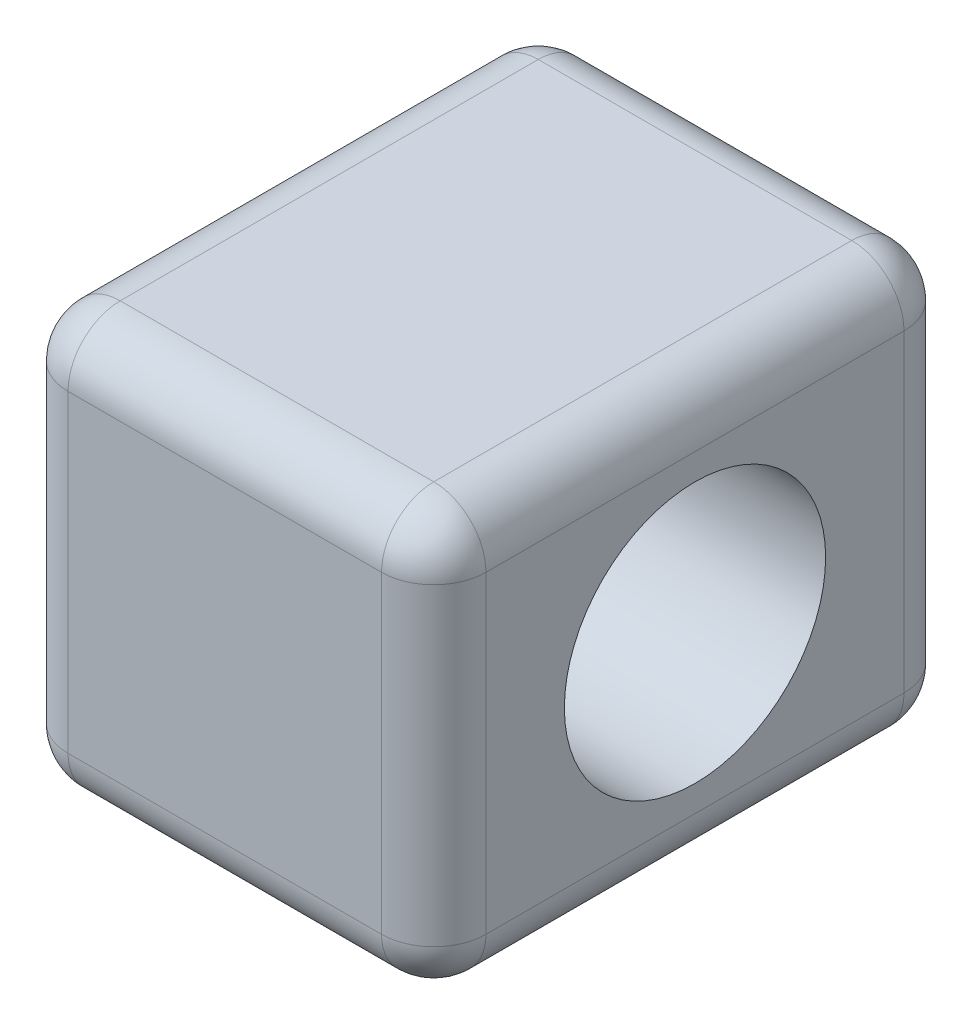
ISO-10303-21;
HEADER;
FILE_DESCRIPTION(('STEP AP214'),'2;1');
FILE_NAME('part.step','',(''),(''),'','','');
FILE_SCHEMA(('AUTOMOTIVE_DESIGN { 1 0 10303 214 1 1 1 1 }'));
ENDSEC;
DATA;
#1=APPLICATION_CONTEXT('core data for automotive mechanical design processes');
#2=APPLICATION_PROTOCOL_DEFINITION('international standard','automotive_design',2000,#1);
#3=PRODUCT_CONTEXT('',#1,'mechanical');
#4=PRODUCT('Part','Part','',(#3));
#5=PRODUCT_RELATED_PRODUCT_CATEGORY('part','',(#4));
#6=PRODUCT_DEFINITION_FORMATION('','',#4);
#7=PRODUCT_DEFINITION_CONTEXT('part definition',#1,'design');
#8=PRODUCT_DEFINITION('design','',#6,#7);
#9=PRODUCT_DEFINITION_SHAPE('','',#8);
#10=(LENGTH_UNIT() NAMED_UNIT(*) SI_UNIT(.MILLI.,.METRE.));
#11=(NAMED_UNIT(*) PLANE_ANGLE_UNIT() SI_UNIT($,.RADIAN.));
#12=(NAMED_UNIT(*) SI_UNIT($,.STERADIAN.) SOLID_ANGLE_UNIT());
#13=UNCERTAINTY_MEASURE_WITH_UNIT(LENGTH_MEASURE(1.E-05),#10,'distance_accuracy_value','');
#14=(GEOMETRIC_REPRESENTATION_CONTEXT(3) GLOBAL_UNCERTAINTY_ASSIGNED_CONTEXT((#13)) GLOBAL_UNIT_ASSIGNED_CONTEXT((#10,
#11,#12)) REPRESENTATION_CONTEXT('',''));
#15=CARTESIAN_POINT('',(0.,0.,0.));
#16=DIRECTION('',(0.,0.,1.));
#17=DIRECTION('',(1.,0.,0.));
#18=AXIS2_PLACEMENT_3D('',#15,#16,#17);
#19=CARTESIAN_POINT('',(0.,8.,10.));
#20=DIRECTION('',(1.,0.,0.));
#21=DIRECTION('',(0.,0.,-1.));
#22=AXIS2_PLACEMENT_3D('',#19,#20,#21);
#23=PLANE('',#22);
#24=DIRECTION('',(0.,-1.,0.));
#25=VECTOR('',#24,1.);
#26=CARTESIAN_POINT('',(0.,8.,0.999999999999999));
#27=LINE('',#26,#25);
#28=CARTESIAN_POINT('',(0.,7.,0.999999999999999));
#29=VERTEX_POINT('',#28);
#30=CARTESIAN_POINT('',(0.,1.,0.999999999999999));
#31=VERTEX_POINT('',#30);
#32=EDGE_CURVE('E165',#29,#31,#27,.T.);
#33=ORIENTED_EDGE('',*,*,#32,.T.);
#34=DIRECTION('',(0.,0.,-1.));
#35=VECTOR('',#34,1.);
#36=CARTESIAN_POINT('',(0.,1.,10.));
#37=LINE('',#36,#35);
#38=CARTESIAN_POINT('',(0.,1.,9.));
#39=VERTEX_POINT('',#38);
#40=EDGE_CURVE('E135',#31,#39,#37,.F.);
#41=ORIENTED_EDGE('',*,*,#40,.T.);
#42=DIRECTION('',(0.,-1.,0.));
#43=VECTOR('',#42,1.);
#44=CARTESIAN_POINT('',(0.,8.,9.));
#45=LINE('',#44,#43);
#46=CARTESIAN_POINT('',(0.,7.,9.));
#47=VERTEX_POINT('',#46);
#48=EDGE_CURVE('E172',#39,#47,#45,.F.);
#49=ORIENTED_EDGE('',*,*,#48,.T.);
#50=DIRECTION('',(0.,0.,-1.));
#51=VECTOR('',#50,1.);
#52=CARTESIAN_POINT('',(0.,7.,10.));
#53=LINE('',#52,#51);
#54=EDGE_CURVE('E170',#47,#29,#53,.T.);
#55=ORIENTED_EDGE('',*,*,#54,.T.);
#56=EDGE_LOOP('',(#33,#41,#49,#55));
#57=FACE_BOUND('',#56,.T.);
#58=CARTESIAN_POINT('',(0.,4.,5.));
#59=DIRECTION('',(1.,0.,0.));
#60=DIRECTION('',(0.,0.,-1.));
#61=AXIS2_PLACEMENT_3D('',#58,#59,#60);
#62=CIRCLE('',#61,2.5);
#63=CARTESIAN_POINT('',(0.,4.,2.5));
#64=VERTEX_POINT('',#63);
#65=EDGE_CURVE('E158',#64,#64,#62,.T.);
#66=ORIENTED_EDGE('',*,*,#65,.T.);
#67=EDGE_LOOP('',(#66));
#68=FACE_BOUND('',#67,.T.);
#69=ADVANCED_FACE('F39',(#57,#68),#23,.F.);
#70=CARTESIAN_POINT('',(0.,0.,10.));
#71=DIRECTION('',(0.,1.,0.));
#72=DIRECTION('',(0.,0.,1.));
#73=AXIS2_PLACEMENT_3D('',#70,#71,#72);
#74=PLANE('',#73);
#75=DIRECTION('',(0.,0.,-1.));
#76=VECTOR('',#75,1.);
#77=CARTESIAN_POINT('',(7.,0.,10.));
#78=LINE('',#77,#76);
#79=CARTESIAN_POINT('',(7.,0.,0.999999999999999));
#80=VERTEX_POINT('',#79);
#81=CARTESIAN_POINT('',(7.,0.,9.));
#82=VERTEX_POINT('',#81);
#83=EDGE_CURVE('E157',#80,#82,#78,.F.);
#84=ORIENTED_EDGE('',*,*,#83,.T.);
#85=DIRECTION('',(1.,0.,0.));
#86=VECTOR('',#85,1.);
#87=CARTESIAN_POINT('',(0.,0.,9.));
#88=LINE('',#87,#86);
#89=CARTESIAN_POINT('',(1.,0.,9.));
#90=VERTEX_POINT('',#89);
#91=EDGE_CURVE('E162',#82,#90,#88,.F.);
#92=ORIENTED_EDGE('',*,*,#91,.T.);
#93=DIRECTION('',(0.,0.,-1.));
#94=VECTOR('',#93,1.);
#95=CARTESIAN_POINT('',(1.,0.,10.));
#96=LINE('',#95,#94);
#97=CARTESIAN_POINT('',(1.,0.,0.999999999999999));
#98=VERTEX_POINT('',#97);
#99=EDGE_CURVE('E133',#90,#98,#96,.T.);
#100=ORIENTED_EDGE('',*,*,#99,.T.);
#101=DIRECTION('',(1.,0.,0.));
#102=VECTOR('',#101,1.);
#103=CARTESIAN_POINT('',(0.,0.,0.999999999999999));
#104=LINE('',#103,#102);
#105=EDGE_CURVE('E151',#98,#80,#104,.T.);
#106=ORIENTED_EDGE('',*,*,#105,.T.);
#107=EDGE_LOOP('',(#84,#92,#100,#106));
#108=FACE_BOUND('',#107,.T.);
#109=ADVANCED_FACE('F160',(#108),#74,.F.);
#110=CARTESIAN_POINT('',(8.,8.,10.));
#111=DIRECTION('',(-1.,0.,0.));
#112=DIRECTION('',(0.,0.,1.));
#113=AXIS2_PLACEMENT_3D('',#110,#111,#112);
#114=PLANE('',#113);
#115=DIRECTION('',(0.,1.,0.));
#116=VECTOR('',#115,1.);
#117=CARTESIAN_POINT('',(8.,0.,9.));
#118=LINE('',#117,#116);
#119=CARTESIAN_POINT('',(8.,7.,9.));
#120=VERTEX_POINT('',#119);
#121=CARTESIAN_POINT('',(8.,1.,9.));
#122=VERTEX_POINT('',#121);
#123=EDGE_CURVE('E179',#120,#122,#118,.F.);
#124=ORIENTED_EDGE('',*,*,#123,.T.);
#125=DIRECTION('',(0.,0.,-1.));
#126=VECTOR('',#125,1.);
#127=CARTESIAN_POINT('',(8.,1.,10.));
#128=LINE('',#127,#126);
#129=CARTESIAN_POINT('',(8.,1.,0.999999999999999));
#130=VERTEX_POINT('',#129);
#131=EDGE_CURVE('E181',#122,#130,#128,.T.);
#132=ORIENTED_EDGE('',*,*,#131,.T.);
#133=DIRECTION('',(0.,1.,0.));
#134=VECTOR('',#133,1.);
#135=CARTESIAN_POINT('',(8.,8.,0.999999999999999));
#136=LINE('',#135,#134);
#137=CARTESIAN_POINT('',(8.,7.,0.999999999999999));
#138=VERTEX_POINT('',#137);
#139=EDGE_CURVE('E175',#130,#138,#136,.T.);
#140=ORIENTED_EDGE('',*,*,#139,.T.);
#141=DIRECTION('',(0.,0.,-1.));
#142=VECTOR('',#141,1.);
#143=CARTESIAN_POINT('',(8.,7.,10.));
#144=LINE('',#143,#142);
#145=EDGE_CURVE('E177',#138,#120,#144,.F.);
#146=ORIENTED_EDGE('',*,*,#145,.T.);
#147=EDGE_LOOP('',(#124,#132,#140,#146));
#148=FACE_BOUND('',#147,.T.);
#149=CARTESIAN_POINT('',(8.,4.,5.));
#150=DIRECTION('',(1.,0.,0.));
#151=DIRECTION('',(0.,0.,-1.));
#152=AXIS2_PLACEMENT_3D('',#149,#150,#151);
#153=CIRCLE('',#152,2.5);
#154=CARTESIAN_POINT('',(8.,4.,2.5));
#155=VERTEX_POINT('',#154);
#156=EDGE_CURVE('E263',#155,#155,#153,.T.);
#157=ORIENTED_EDGE('',*,*,#156,.F.);
#158=EDGE_LOOP('',(#157));
#159=FACE_BOUND('',#158,.T.);
#160=ADVANCED_FACE('F296',(#148,#159),#114,.F.);
#161=CARTESIAN_POINT('',(0.,8.,10.));
#162=DIRECTION('',(0.,-1.,0.));
#163=DIRECTION('',(0.,0.,-1.));
#164=AXIS2_PLACEMENT_3D('',#161,#162,#163);
#165=PLANE('',#164);
#166=DIRECTION('',(-1.,0.,0.));
#167=VECTOR('',#166,1.);
#168=CARTESIAN_POINT('',(8.,8.,9.));
#169=LINE('',#168,#167);
#170=CARTESIAN_POINT('',(1.,8.,9.));
#171=VERTEX_POINT('',#170);
#172=CARTESIAN_POINT('',(7.,8.,9.));
#173=VERTEX_POINT('',#172);
#174=EDGE_CURVE('E197',#171,#173,#169,.F.);
#175=ORIENTED_EDGE('',*,*,#174,.T.);
#176=DIRECTION('',(0.,0.,-1.));
#177=VECTOR('',#176,1.);
#178=CARTESIAN_POINT('',(7.,8.,10.));
#179=LINE('',#178,#177);
#180=CARTESIAN_POINT('',(7.,8.,0.999999999999999));
#181=VERTEX_POINT('',#180);
#182=EDGE_CURVE('E199',#173,#181,#179,.T.);
#183=ORIENTED_EDGE('',*,*,#182,.T.);
#184=DIRECTION('',(-1.,0.,0.));
#185=VECTOR('',#184,1.);
#186=CARTESIAN_POINT('',(0.,8.,0.999999999999999));
#187=LINE('',#186,#185);
#188=CARTESIAN_POINT('',(1.,8.,0.999999999999999));
#189=VERTEX_POINT('',#188);
#190=EDGE_CURVE('E193',#181,#189,#187,.T.);
#191=ORIENTED_EDGE('',*,*,#190,.T.);
#192=DIRECTION('',(0.,0.,-1.));
#193=VECTOR('',#192,1.);
#194=CARTESIAN_POINT('',(1.,8.,10.));
#195=LINE('',#194,#193);
#196=EDGE_CURVE('E195',#189,#171,#195,.F.);
#197=ORIENTED_EDGE('',*,*,#196,.T.);
#198=EDGE_LOOP('',(#175,#183,#191,#197));
#199=FACE_BOUND('',#198,.T.);
#200=ADVANCED_FACE('F380',(#199),#165,.F.);
#201=CARTESIAN_POINT('',(0.,0.,10.));
#202=DIRECTION('',(0.,0.,1.));
#203=DIRECTION('',(1.,0.,0.));
#204=AXIS2_PLACEMENT_3D('',#201,#202,#203);
#205=PLANE('',#204);
#206=DIRECTION('',(1.,0.,0.));
#207=VECTOR('',#206,1.);
#208=CARTESIAN_POINT('',(8.,1.,10.));
#209=LINE('',#208,#207);
#210=CARTESIAN_POINT('',(1.,1.,10.));
#211=VERTEX_POINT('',#210);
#212=CARTESIAN_POINT('',(7.,1.,10.));
#213=VERTEX_POINT('',#212);
#214=EDGE_CURVE('E188',#211,#213,#209,.T.);
#215=ORIENTED_EDGE('',*,*,#214,.T.);
#216=DIRECTION('',(0.,1.,0.));
#217=VECTOR('',#216,1.);
#218=CARTESIAN_POINT('',(7.,8.,10.));
#219=LINE('',#218,#217);
#220=CARTESIAN_POINT('',(7.,7.,10.));
#221=VERTEX_POINT('',#220);
#222=EDGE_CURVE('E190',#213,#221,#219,.T.);
#223=ORIENTED_EDGE('',*,*,#222,.T.);
#224=DIRECTION('',(-1.,0.,0.));
#225=VECTOR('',#224,1.);
#226=CARTESIAN_POINT('',(0.,7.,10.));
#227=LINE('',#226,#225);
#228=CARTESIAN_POINT('',(1.,7.,10.));
#229=VERTEX_POINT('',#228);
#230=EDGE_CURVE('E184',#221,#229,#227,.T.);
#231=ORIENTED_EDGE('',*,*,#230,.T.);
#232=DIRECTION('',(0.,-1.,0.));
#233=VECTOR('',#232,1.);
#234=CARTESIAN_POINT('',(1.,0.,10.));
#235=LINE('',#234,#233);
#236=EDGE_CURVE('E186',#229,#211,#235,.T.);
#237=ORIENTED_EDGE('',*,*,#236,.T.);
#238=EDGE_LOOP('',(#215,#223,#231,#237));
#239=FACE_BOUND('',#238,.T.);
#240=ADVANCED_FACE('F287',(#239),#205,.T.);
#241=CARTESIAN_POINT('',(0.,0.,0.));
#242=DIRECTION('',(0.,0.,1.));
#243=DIRECTION('',(1.,0.,0.));
#244=AXIS2_PLACEMENT_3D('',#241,#242,#243);
#245=PLANE('',#244);
#246=DIRECTION('',(0.,1.,0.));
#247=VECTOR('',#246,1.);
#248=CARTESIAN_POINT('',(7.,0.,0.));
#249=LINE('',#248,#247);
#250=CARTESIAN_POINT('',(7.,7.,0.));
#251=VERTEX_POINT('',#250);
#252=CARTESIAN_POINT('',(7.,1.,0.));
#253=VERTEX_POINT('',#252);
#254=EDGE_CURVE('E48',#251,#253,#249,.F.);
#255=ORIENTED_EDGE('',*,*,#254,.T.);
#256=DIRECTION('',(1.,0.,0.));
#257=VECTOR('',#256,1.);
#258=CARTESIAN_POINT('',(0.,1.,0.));
#259=LINE('',#258,#257);
#260=CARTESIAN_POINT('',(1.,1.,0.));
#261=VERTEX_POINT('',#260);
#262=EDGE_CURVE('E11',#253,#261,#259,.F.);
#263=ORIENTED_EDGE('',*,*,#262,.T.);
#264=DIRECTION('',(0.,-1.,0.));
#265=VECTOR('',#264,1.);
#266=CARTESIAN_POINT('',(1.,0.,0.));
#267=LINE('',#266,#265);
#268=CARTESIAN_POINT('',(1.,7.,0.));
#269=VERTEX_POINT('',#268);
#270=EDGE_CURVE('E202',#261,#269,#267,.F.);
#271=ORIENTED_EDGE('',*,*,#270,.T.);
#272=DIRECTION('',(-1.,0.,0.));
#273=VECTOR('',#272,1.);
#274=CARTESIAN_POINT('',(0.,7.,0.));
#275=LINE('',#274,#273);
#276=EDGE_CURVE('E59',#269,#251,#275,.F.);
#277=ORIENTED_EDGE('',*,*,#276,.T.);
#278=EDGE_LOOP('',(#255,#263,#271,#277));
#279=FACE_BOUND('',#278,.T.);
#280=ADVANCED_FACE('F279',(#279),#245,.F.);
#281=CARTESIAN_POINT('',(0.,4.,5.));
#282=DIRECTION('',(1.,0.,0.));
#283=DIRECTION('',(0.,0.,-1.));
#284=AXIS2_PLACEMENT_3D('',#281,#282,#283);
#285=CYLINDRICAL_SURFACE('',#284,2.5);
#286=ORIENTED_EDGE('',*,*,#65,.F.);
#287=EDGE_LOOP('',(#286));
#288=FACE_BOUND('',#287,.T.);
#289=ORIENTED_EDGE('',*,*,#156,.T.);
#290=EDGE_LOOP('',(#289));
#291=FACE_BOUND('',#290,.T.);
#292=ADVANCED_FACE('F277',(#288,#291),#285,.F.);
#293=CARTESIAN_POINT('',(7.,7.,10.));
#294=DIRECTION('',(0.,0.,-1.));
#295=DIRECTION('',(-1.,0.,0.));
#296=AXIS2_PLACEMENT_3D('',#293,#294,#295);
#297=CYLINDRICAL_SURFACE('',#296,1.);
#298=CARTESIAN_POINT('',(7.,7.,9.));
#299=DIRECTION('',(0.,0.,1.));
#300=DIRECTION('',(1.,0.,0.));
#301=AXIS2_PLACEMENT_3D('',#298,#299,#300);
#302=CIRCLE('',#301,1.);
#303=EDGE_CURVE('E43',#120,#173,#302,.T.);
#304=ORIENTED_EDGE('',*,*,#303,.F.);
#305=ORIENTED_EDGE('',*,*,#145,.F.);
#306=CARTESIAN_POINT('',(7.,7.,0.999999999999999));
#307=DIRECTION('',(0.,0.,-1.));
#308=DIRECTION('',(-1.,0.,0.));
#309=AXIS2_PLACEMENT_3D('',#306,#307,#308);
#310=CIRCLE('',#309,1.);
#311=EDGE_CURVE('E256',#181,#138,#310,.T.);
#312=ORIENTED_EDGE('',*,*,#311,.F.);
#313=ORIENTED_EDGE('',*,*,#182,.F.);
#314=EDGE_LOOP('',(#304,#305,#312,#313));
#315=FACE_BOUND('',#314,.T.);
#316=ADVANCED_FACE('F41',(#315),#297,.T.);
#317=CARTESIAN_POINT('',(7.,7.,9.));
#318=DIRECTION('',(0.,1.,0.));
#319=DIRECTION('',(0.,0.,1.));
#320=AXIS2_PLACEMENT_3D('',#317,#318,#319);
#321=SPHERICAL_SURFACE('',#320,1.);
#322=CARTESIAN_POINT('',(7.,7.,9.));
#323=DIRECTION('',(0.,1.,0.));
#324=DIRECTION('',(0.,0.,1.));
#325=AXIS2_PLACEMENT_3D('',#322,#323,#324);
#326=CIRCLE('',#325,1.);
#327=EDGE_CURVE('E251',#120,#221,#326,.F.);
#328=ORIENTED_EDGE('',*,*,#327,.F.);
#329=ORIENTED_EDGE('',*,*,#303,.T.);
#330=CARTESIAN_POINT('',(7.,7.,9.));
#331=DIRECTION('',(1.,0.,0.));
#332=DIRECTION('',(0.,0.,-1.));
#333=AXIS2_PLACEMENT_3D('',#330,#331,#332);
#334=CIRCLE('',#333,1.);
#335=EDGE_CURVE('E254',#221,#173,#334,.F.);
#336=ORIENTED_EDGE('',*,*,#335,.F.);
#337=EDGE_LOOP('',(#328,#329,#336));
#338=FACE_BOUND('',#337,.T.);
#339=ADVANCED_FACE('F285',(#338),#321,.T.);
#340=CARTESIAN_POINT('',(7.,7.,1.));
#341=DIRECTION('',(1.,0.,0.));
#342=DIRECTION('',(0.,0.,-1.));
#343=AXIS2_PLACEMENT_3D('',#340,#341,#342);
#344=SPHERICAL_SURFACE('',#343,1.);
#345=CARTESIAN_POINT('',(7.,7.,1.));
#346=DIRECTION('',(1.,0.,0.));
#347=DIRECTION('',(0.,0.,-1.));
#348=AXIS2_PLACEMENT_3D('',#345,#346,#347);
#349=CIRCLE('',#348,1.);
#350=EDGE_CURVE('E246',#181,#251,#349,.F.);
#351=ORIENTED_EDGE('',*,*,#350,.F.);
#352=ORIENTED_EDGE('',*,*,#311,.T.);
#353=CARTESIAN_POINT('',(7.,7.,0.999999999999999));
#354=DIRECTION('',(0.,1.,0.));
#355=DIRECTION('',(0.,0.,1.));
#356=AXIS2_PLACEMENT_3D('',#353,#354,#355);
#357=CIRCLE('',#356,1.);
#358=EDGE_CURVE('E248',#251,#138,#357,.F.);
#359=ORIENTED_EDGE('',*,*,#358,.F.);
#360=EDGE_LOOP('',(#351,#352,#359));
#361=FACE_BOUND('',#360,.T.);
#362=ADVANCED_FACE('F361',(#361),#344,.T.);
#363=CARTESIAN_POINT('',(0.,7.,9.));
#364=DIRECTION('',(1.,0.,0.));
#365=DIRECTION('',(0.,0.,-1.));
#366=AXIS2_PLACEMENT_3D('',#363,#364,#365);
#367=CYLINDRICAL_SURFACE('',#366,1.);
#368=ORIENTED_EDGE('',*,*,#335,.T.);
#369=ORIENTED_EDGE('',*,*,#174,.F.);
#370=CARTESIAN_POINT('',(1.,7.,9.));
#371=DIRECTION('',(-1.,0.,0.));
#372=DIRECTION('',(0.,0.,1.));
#373=AXIS2_PLACEMENT_3D('',#370,#371,#372);
#374=CIRCLE('',#373,1.);
#375=EDGE_CURVE('E240',#229,#171,#374,.T.);
#376=ORIENTED_EDGE('',*,*,#375,.F.);
#377=ORIENTED_EDGE('',*,*,#230,.F.);
#378=EDGE_LOOP('',(#368,#369,#376,#377));
#379=FACE_BOUND('',#378,.T.);
#380=ADVANCED_FACE('F357',(#379),#367,.T.);
#381=CARTESIAN_POINT('',(7.,0.,9.));
#382=DIRECTION('',(0.,-1.,0.));
#383=DIRECTION('',(0.,0.,-1.));
#384=AXIS2_PLACEMENT_3D('',#381,#382,#383);
#385=CYLINDRICAL_SURFACE('',#384,1.);
#386=ORIENTED_EDGE('',*,*,#327,.T.);
#387=ORIENTED_EDGE('',*,*,#222,.F.);
#388=CARTESIAN_POINT('',(7.,1.,9.));
#389=DIRECTION('',(0.,-1.,0.));
#390=DIRECTION('',(0.,0.,-1.));
#391=AXIS2_PLACEMENT_3D('',#388,#389,#390);
#392=CIRCLE('',#391,1.);
#393=EDGE_CURVE('E237',#122,#213,#392,.T.);
#394=ORIENTED_EDGE('',*,*,#393,.F.);
#395=ORIENTED_EDGE('',*,*,#123,.F.);
#396=EDGE_LOOP('',(#386,#387,#394,#395));
#397=FACE_BOUND('',#396,.T.);
#398=ADVANCED_FACE('F353',(#397),#385,.T.);
#399=CARTESIAN_POINT('',(7.,1.,10.));
#400=DIRECTION('',(0.,0.,-1.));
#401=DIRECTION('',(-1.,0.,0.));
#402=AXIS2_PLACEMENT_3D('',#399,#400,#401);
#403=CYLINDRICAL_SURFACE('',#402,1.);
#404=CARTESIAN_POINT('',(7.,1.,0.999999999999999));
#405=DIRECTION('',(0.,0.,-1.));
#406=DIRECTION('',(-1.,0.,0.));
#407=AXIS2_PLACEMENT_3D('',#404,#405,#406);
#408=CIRCLE('',#407,1.);
#409=EDGE_CURVE('E231',#130,#80,#408,.T.);
#410=ORIENTED_EDGE('',*,*,#409,.F.);
#411=ORIENTED_EDGE('',*,*,#131,.F.);
#412=CARTESIAN_POINT('',(7.,1.,9.));
#413=DIRECTION('',(0.,0.,1.));
#414=DIRECTION('',(1.,0.,0.));
#415=AXIS2_PLACEMENT_3D('',#412,#413,#414);
#416=CIRCLE('',#415,1.);
#417=EDGE_CURVE('E234',#82,#122,#416,.T.);
#418=ORIENTED_EDGE('',*,*,#417,.F.);
#419=ORIENTED_EDGE('',*,*,#83,.F.);
#420=EDGE_LOOP('',(#410,#411,#418,#419));
#421=FACE_BOUND('',#420,.T.);
#422=ADVANCED_FACE('F349',(#421),#403,.T.);
#423=CARTESIAN_POINT('',(7.,8.,0.999999999999999));
#424=DIRECTION('',(0.,1.,0.));
#425=DIRECTION('',(0.,0.,1.));
#426=AXIS2_PLACEMENT_3D('',#423,#424,#425);
#427=CYLINDRICAL_SURFACE('',#426,1.);
#428=ORIENTED_EDGE('',*,*,#358,.T.);
#429=ORIENTED_EDGE('',*,*,#139,.F.);
#430=CARTESIAN_POINT('',(7.,1.,1.));
#431=DIRECTION('',(0.,-1.,0.));
#432=DIRECTION('',(0.,0.,-1.));
#433=AXIS2_PLACEMENT_3D('',#430,#431,#432);
#434=CIRCLE('',#433,1.);
#435=EDGE_CURVE('E229',#253,#130,#434,.T.);
#436=ORIENTED_EDGE('',*,*,#435,.F.);
#437=ORIENTED_EDGE('',*,*,#254,.F.);
#438=EDGE_LOOP('',(#428,#429,#436,#437));
#439=FACE_BOUND('',#438,.T.);
#440=ADVANCED_FACE('F345',(#439),#427,.T.);
#441=CARTESIAN_POINT('',(0.,7.,0.999999999999999));
#442=DIRECTION('',(-1.,0.,0.));
#443=DIRECTION('',(0.,0.,1.));
#444=AXIS2_PLACEMENT_3D('',#441,#442,#443);
#445=CYLINDRICAL_SURFACE('',#444,1.);
#446=ORIENTED_EDGE('',*,*,#350,.T.);
#447=ORIENTED_EDGE('',*,*,#276,.F.);
#448=CARTESIAN_POINT('',(1.,7.,0.999999999999999));
#449=DIRECTION('',(-1.,0.,0.));
#450=DIRECTION('',(0.,0.,1.));
#451=AXIS2_PLACEMENT_3D('',#448,#449,#450);
#452=CIRCLE('',#451,1.);
#453=EDGE_CURVE('E226',#189,#269,#452,.T.);
#454=ORIENTED_EDGE('',*,*,#453,.F.);
#455=ORIENTED_EDGE('',*,*,#190,.F.);
#456=EDGE_LOOP('',(#446,#447,#454,#455));
#457=FACE_BOUND('',#456,.T.);
#458=ADVANCED_FACE('F341',(#457),#445,.T.);
#459=CARTESIAN_POINT('',(1.,7.,10.));
#460=DIRECTION('',(0.,0.,-1.));
#461=DIRECTION('',(-1.,0.,0.));
#462=AXIS2_PLACEMENT_3D('',#459,#460,#461);
#463=CYLINDRICAL_SURFACE('',#462,1.);
#464=CARTESIAN_POINT('',(1.,7.,9.));
#465=DIRECTION('',(0.,0.,1.));
#466=DIRECTION('',(1.,0.,0.));
#467=AXIS2_PLACEMENT_3D('',#464,#465,#466);
#468=CIRCLE('',#467,1.);
#469=EDGE_CURVE('E243',#171,#47,#468,.T.);
#470=ORIENTED_EDGE('',*,*,#469,.F.);
#471=ORIENTED_EDGE('',*,*,#196,.F.);
#472=CARTESIAN_POINT('',(1.,7.,0.999999999999999));
#473=DIRECTION('',(0.,0.,-1.));
#474=DIRECTION('',(-1.,0.,0.));
#475=AXIS2_PLACEMENT_3D('',#472,#473,#474);
#476=CIRCLE('',#475,1.);
#477=EDGE_CURVE('E223',#29,#189,#476,.T.);
#478=ORIENTED_EDGE('',*,*,#477,.F.);
#479=ORIENTED_EDGE('',*,*,#54,.F.);
#480=EDGE_LOOP('',(#470,#471,#478,#479));
#481=FACE_BOUND('',#480,.T.);
#482=ADVANCED_FACE('F337',(#481),#463,.T.);
#483=CARTESIAN_POINT('',(1.,7.,9.));
#484=DIRECTION('',(0.,1.,0.));
#485=DIRECTION('',(0.,0.,1.));
#486=AXIS2_PLACEMENT_3D('',#483,#484,#485);
#487=SPHERICAL_SURFACE('',#486,1.);
#488=ORIENTED_EDGE('',*,*,#375,.T.);
#489=ORIENTED_EDGE('',*,*,#469,.T.);
#490=CARTESIAN_POINT('',(1.,7.,9.));
#491=DIRECTION('',(0.,1.,0.));
#492=DIRECTION('',(0.,0.,1.));
#493=AXIS2_PLACEMENT_3D('',#490,#491,#492);
#494=CIRCLE('',#493,1.);
#495=EDGE_CURVE('E220',#229,#47,#494,.F.);
#496=ORIENTED_EDGE('',*,*,#495,.F.);
#497=EDGE_LOOP('',(#488,#489,#496));
#498=FACE_BOUND('',#497,.T.);
#499=ADVANCED_FACE('F333',(#498),#487,.T.);
#500=CARTESIAN_POINT('',(7.,1.,9.));
#501=DIRECTION('',(1.,0.,0.));
#502=DIRECTION('',(0.,0.,-1.));
#503=AXIS2_PLACEMENT_3D('',#500,#501,#502);
#504=SPHERICAL_SURFACE('',#503,1.);
#505=ORIENTED_EDGE('',*,*,#417,.T.);
#506=ORIENTED_EDGE('',*,*,#393,.T.);
#507=CARTESIAN_POINT('',(7.,1.,9.));
#508=DIRECTION('',(1.,0.,0.));
#509=DIRECTION('',(0.,0.,-1.));
#510=AXIS2_PLACEMENT_3D('',#507,#508,#509);
#511=CIRCLE('',#510,1.);
#512=EDGE_CURVE('E217',#82,#213,#511,.F.);
#513=ORIENTED_EDGE('',*,*,#512,.F.);
#514=EDGE_LOOP('',(#505,#506,#513));
#515=FACE_BOUND('',#514,.T.);
#516=ADVANCED_FACE('F329',(#515),#504,.T.);
#517=CARTESIAN_POINT('',(7.,1.,1.));
#518=DIRECTION('',(1.,0.,0.));
#519=DIRECTION('',(0.,0.,-1.));
#520=AXIS2_PLACEMENT_3D('',#517,#518,#519);
#521=SPHERICAL_SURFACE('',#520,1.);
#522=ORIENTED_EDGE('',*,*,#435,.T.);
#523=ORIENTED_EDGE('',*,*,#409,.T.);
#524=CARTESIAN_POINT('',(7.,1.,0.999999999999999));
#525=DIRECTION('',(1.,0.,0.));
#526=DIRECTION('',(0.,0.,-1.));
#527=AXIS2_PLACEMENT_3D('',#524,#525,#526);
#528=CIRCLE('',#527,1.);
#529=EDGE_CURVE('E154',#253,#80,#528,.F.);
#530=ORIENTED_EDGE('',*,*,#529,.F.);
#531=EDGE_LOOP('',(#522,#523,#530));
#532=FACE_BOUND('',#531,.T.);
#533=ADVANCED_FACE('F325',(#532),#521,.T.);
#534=CARTESIAN_POINT('',(1.,7.,1.));
#535=DIRECTION('',(0.,1.,0.));
#536=DIRECTION('',(0.,0.,1.));
#537=AXIS2_PLACEMENT_3D('',#534,#535,#536);
#538=SPHERICAL_SURFACE('',#537,1.);
#539=ORIENTED_EDGE('',*,*,#477,.T.);
#540=ORIENTED_EDGE('',*,*,#453,.T.);
#541=CARTESIAN_POINT('',(1.,7.,1.));
#542=DIRECTION('',(0.,1.,0.));
#543=DIRECTION('',(0.,0.,1.));
#544=AXIS2_PLACEMENT_3D('',#541,#542,#543);
#545=CIRCLE('',#544,1.);
#546=EDGE_CURVE('E213',#29,#269,#545,.F.);
#547=ORIENTED_EDGE('',*,*,#546,.F.);
#548=EDGE_LOOP('',(#539,#540,#547));
#549=FACE_BOUND('',#548,.T.);
#550=ADVANCED_FACE('F321',(#549),#538,.T.);
#551=CARTESIAN_POINT('',(1.,0.,9.));
#552=DIRECTION('',(0.,1.,0.));
#553=DIRECTION('',(0.,0.,1.));
#554=AXIS2_PLACEMENT_3D('',#551,#552,#553);
#555=CYLINDRICAL_SURFACE('',#554,1.);
#556=ORIENTED_EDGE('',*,*,#495,.T.);
#557=ORIENTED_EDGE('',*,*,#48,.F.);
#558=CARTESIAN_POINT('',(1.,1.,9.));
#559=DIRECTION('',(0.,-1.,0.));
#560=DIRECTION('',(0.,0.,-1.));
#561=AXIS2_PLACEMENT_3D('',#558,#559,#560);
#562=CIRCLE('',#561,1.);
#563=EDGE_CURVE('E210',#211,#39,#562,.T.);
#564=ORIENTED_EDGE('',*,*,#563,.F.);
#565=ORIENTED_EDGE('',*,*,#236,.F.);
#566=EDGE_LOOP('',(#556,#557,#564,#565));
#567=FACE_BOUND('',#566,.T.);
#568=ADVANCED_FACE('F317',(#567),#555,.T.);
#569=CARTESIAN_POINT('',(0.,1.,9.));
#570=DIRECTION('',(-1.,0.,0.));
#571=DIRECTION('',(0.,0.,1.));
#572=AXIS2_PLACEMENT_3D('',#569,#570,#571);
#573=CYLINDRICAL_SURFACE('',#572,1.);
#574=ORIENTED_EDGE('',*,*,#512,.T.);
#575=ORIENTED_EDGE('',*,*,#214,.F.);
#576=CARTESIAN_POINT('',(1.,1.,9.));
#577=DIRECTION('',(-1.,0.,0.));
#578=DIRECTION('',(0.,0.,1.));
#579=AXIS2_PLACEMENT_3D('',#576,#577,#578);
#580=CIRCLE('',#579,1.);
#581=EDGE_CURVE('E148',#90,#211,#580,.T.);
#582=ORIENTED_EDGE('',*,*,#581,.F.);
#583=ORIENTED_EDGE('',*,*,#91,.F.);
#584=EDGE_LOOP('',(#574,#575,#582,#583));
#585=FACE_BOUND('',#584,.T.);
#586=ADVANCED_FACE('F314',(#585),#573,.T.);
#587=CARTESIAN_POINT('',(0.,1.,0.999999999999999));
#588=DIRECTION('',(1.,0.,0.));
#589=DIRECTION('',(0.,0.,-1.));
#590=AXIS2_PLACEMENT_3D('',#587,#588,#589);
#591=CYLINDRICAL_SURFACE('',#590,1.);
#592=ORIENTED_EDGE('',*,*,#529,.T.);
#593=ORIENTED_EDGE('',*,*,#105,.F.);
#594=CARTESIAN_POINT('',(1.,1.,1.));
#595=DIRECTION('',(-1.,0.,0.));
#596=DIRECTION('',(0.,0.,1.));
#597=AXIS2_PLACEMENT_3D('',#594,#595,#596);
#598=CIRCLE('',#597,1.);
#599=EDGE_CURVE('E140',#261,#98,#598,.T.);
#600=ORIENTED_EDGE('',*,*,#599,.F.);
#601=ORIENTED_EDGE('',*,*,#262,.F.);
#602=EDGE_LOOP('',(#592,#593,#600,#601));
#603=FACE_BOUND('',#602,.T.);
#604=ADVANCED_FACE('F152',(#603),#591,.T.);
#605=CARTESIAN_POINT('',(1.,8.,0.999999999999999));
#606=DIRECTION('',(0.,-1.,0.));
#607=DIRECTION('',(0.,0.,-1.));
#608=AXIS2_PLACEMENT_3D('',#605,#606,#607);
#609=CYLINDRICAL_SURFACE('',#608,1.);
#610=ORIENTED_EDGE('',*,*,#546,.T.);
#611=ORIENTED_EDGE('',*,*,#270,.F.);
#612=CARTESIAN_POINT('',(1.,1.,0.999999999999999));
#613=DIRECTION('',(0.,-1.,0.));
#614=DIRECTION('',(0.,0.,-1.));
#615=AXIS2_PLACEMENT_3D('',#612,#613,#614);
#616=CIRCLE('',#615,1.);
#617=EDGE_CURVE('E144',#31,#261,#616,.T.);
#618=ORIENTED_EDGE('',*,*,#617,.F.);
#619=ORIENTED_EDGE('',*,*,#32,.F.);
#620=EDGE_LOOP('',(#610,#611,#618,#619));
#621=FACE_BOUND('',#620,.T.);
#622=ADVANCED_FACE('F307',(#621),#609,.T.);
#623=CARTESIAN_POINT('',(1.,1.,9.));
#624=DIRECTION('',(0.,0.,1.));
#625=DIRECTION('',(1.,0.,0.));
#626=AXIS2_PLACEMENT_3D('',#623,#624,#625);
#627=SPHERICAL_SURFACE('',#626,1.);
#628=ORIENTED_EDGE('',*,*,#581,.T.);
#629=ORIENTED_EDGE('',*,*,#563,.T.);
#630=CARTESIAN_POINT('',(1.,1.,9.));
#631=DIRECTION('',(0.,0.,1.));
#632=DIRECTION('',(1.,0.,0.));
#633=AXIS2_PLACEMENT_3D('',#630,#631,#632);
#634=CIRCLE('',#633,1.);
#635=EDGE_CURVE('E137',#90,#39,#634,.F.);
#636=ORIENTED_EDGE('',*,*,#635,.F.);
#637=EDGE_LOOP('',(#628,#629,#636));
#638=FACE_BOUND('',#637,.T.);
#639=ADVANCED_FACE('F304',(#638),#627,.T.);
#640=CARTESIAN_POINT('',(1.,1.,1.));
#641=DIRECTION('',(0.,0.,-1.));
#642=DIRECTION('',(-1.,0.,0.));
#643=AXIS2_PLACEMENT_3D('',#640,#641,#642);
#644=SPHERICAL_SURFACE('',#643,1.);
#645=ORIENTED_EDGE('',*,*,#617,.T.);
#646=ORIENTED_EDGE('',*,*,#599,.T.);
#647=CARTESIAN_POINT('',(1.,1.,0.999999999999999));
#648=DIRECTION('',(0.,0.,-1.));
#649=DIRECTION('',(-1.,0.,0.));
#650=AXIS2_PLACEMENT_3D('',#647,#648,#649);
#651=CIRCLE('',#650,1.);
#652=EDGE_CURVE('E129',#31,#98,#651,.F.);
#653=ORIENTED_EDGE('',*,*,#652,.F.);
#654=EDGE_LOOP('',(#645,#646,#653));
#655=FACE_BOUND('',#654,.T.);
#656=ADVANCED_FACE('F142',(#655),#644,.T.);
#657=CARTESIAN_POINT('',(1.,1.,10.));
#658=DIRECTION('',(0.,0.,-1.));
#659=DIRECTION('',(-1.,0.,0.));
#660=AXIS2_PLACEMENT_3D('',#657,#658,#659);
#661=CYLINDRICAL_SURFACE('',#660,1.);
#662=ORIENTED_EDGE('',*,*,#635,.T.);
#663=ORIENTED_EDGE('',*,*,#40,.F.);
#664=ORIENTED_EDGE('',*,*,#652,.T.);
#665=ORIENTED_EDGE('',*,*,#99,.F.);
#666=EDGE_LOOP('',(#662,#663,#664,#665));
#667=FACE_BOUND('',#666,.T.);
#668=ADVANCED_FACE('F131',(#667),#661,.T.);
#669=CLOSED_SHELL('',(#69,#109,#160,#200,#240,#280,#292,#316,#339,#362,#380,#398,#422,#440,#458,
#482,#499,#516,#533,#550,#568,#586,#604,#622,#639,#656,#668));
#670=MANIFOLD_SOLID_BREP('B2',#669);
#671=ADVANCED_BREP_SHAPE_REPRESENTATION('',(#18,#670),#14);
#672=SHAPE_DEFINITION_REPRESENTATION(#9,#671);
ENDSEC;
END-ISO-10303-21;
